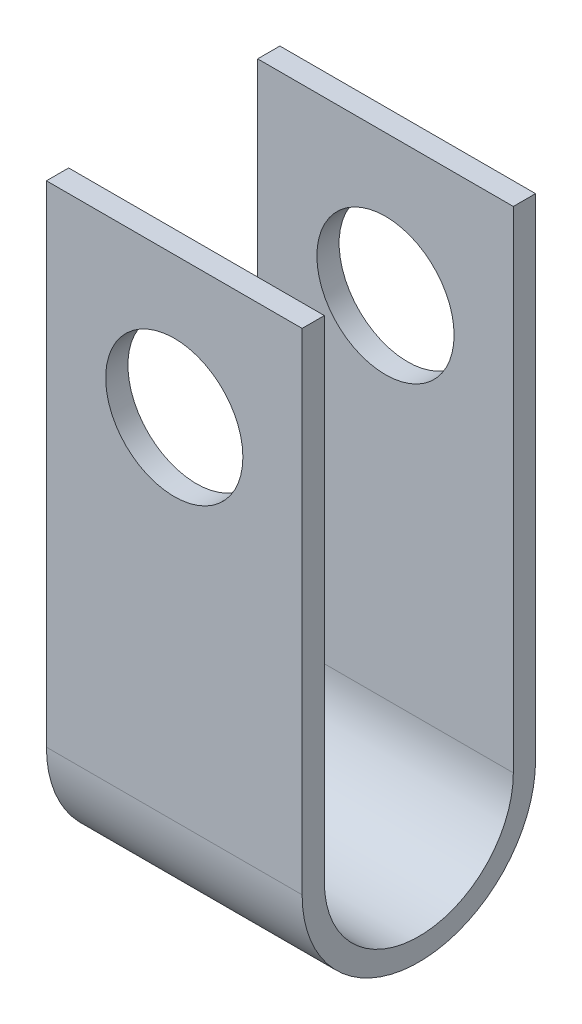
ISO-10303-21;
HEADER;
FILE_DESCRIPTION(('STEP AP214'),'2;1');
FILE_NAME('part.step','',(''),(''),'','','');
FILE_SCHEMA(('AUTOMOTIVE_DESIGN { 1 0 10303 214 1 1 1 1 }'));
ENDSEC;
DATA;
#1=APPLICATION_CONTEXT('core data for automotive mechanical design processes');
#2=APPLICATION_PROTOCOL_DEFINITION('international standard','automotive_design',2000,#1);
#3=PRODUCT_CONTEXT('',#1,'mechanical');
#4=PRODUCT('Part','Part','',(#3));
#5=PRODUCT_RELATED_PRODUCT_CATEGORY('part','',(#4));
#6=PRODUCT_DEFINITION_FORMATION('','',#4);
#7=PRODUCT_DEFINITION_CONTEXT('part definition',#1,'design');
#8=PRODUCT_DEFINITION('design','',#6,#7);
#9=PRODUCT_DEFINITION_SHAPE('','',#8);
#10=(LENGTH_UNIT() NAMED_UNIT(*) SI_UNIT(.MILLI.,.METRE.));
#11=(NAMED_UNIT(*) PLANE_ANGLE_UNIT() SI_UNIT($,.RADIAN.));
#12=(NAMED_UNIT(*) SI_UNIT($,.STERADIAN.) SOLID_ANGLE_UNIT());
#13=UNCERTAINTY_MEASURE_WITH_UNIT(LENGTH_MEASURE(1.E-05),#10,'distance_accuracy_value','');
#14=(GEOMETRIC_REPRESENTATION_CONTEXT(3) GLOBAL_UNCERTAINTY_ASSIGNED_CONTEXT((#13)) GLOBAL_UNIT_ASSIGNED_CONTEXT((#10,
#11,#12)) REPRESENTATION_CONTEXT('',''));
#15=CARTESIAN_POINT('',(0.,0.,0.));
#16=DIRECTION('',(0.,0.,1.));
#17=DIRECTION('',(1.,0.,0.));
#18=AXIS2_PLACEMENT_3D('',#15,#16,#17);
#19=CARTESIAN_POINT('',(11.5,-13.3553157194639,0.));
#20=DIRECTION('',(-1.,0.,0.));
#21=DIRECTION('',(0.,0.,1.));
#22=AXIS2_PLACEMENT_3D('',#19,#20,#21);
#23=CYLINDRICAL_SURFACE('',#22,8.50000000000006);
#24=CARTESIAN_POINT('',(-11.5,-13.3553157194639,0.));
#25=DIRECTION('',(-1.,0.,0.));
#26=DIRECTION('',(0.,0.,-1.));
#27=AXIS2_PLACEMENT_3D('',#24,#25,#26);
#28=CIRCLE('',#27,8.50000000000006);
#29=CARTESIAN_POINT('',(-11.5,-13.3553157194639,-8.50000000000006));
#30=VERTEX_POINT('',#29);
#31=CARTESIAN_POINT('',(-11.5,-13.3553157194639,8.50000000000006));
#32=VERTEX_POINT('',#31);
#33=EDGE_CURVE('E132',#30,#32,#28,.T.);
#34=ORIENTED_EDGE('',*,*,#33,.T.);
#35=DIRECTION('',(-1.,0.,0.));
#36=VECTOR('',#35,1.);
#37=CARTESIAN_POINT('',(11.5,-13.3553157194639,8.50000000000006));
#38=LINE('',#37,#36);
#39=CARTESIAN_POINT('',(11.5,-13.3553157194639,8.50000000000006));
#40=VERTEX_POINT('',#39);
#41=EDGE_CURVE('E11',#40,#32,#38,.T.);
#42=ORIENTED_EDGE('',*,*,#41,.F.);
#43=CARTESIAN_POINT('',(11.5,-13.3553157194639,0.));
#44=DIRECTION('',(-1.,0.,0.));
#45=DIRECTION('',(0.,0.,-1.));
#46=AXIS2_PLACEMENT_3D('',#43,#44,#45);
#47=CIRCLE('',#46,8.50000000000006);
#48=CARTESIAN_POINT('',(11.5,-13.3553157194639,-8.50000000000006));
#49=VERTEX_POINT('',#48);
#50=EDGE_CURVE('E147',#49,#40,#47,.T.);
#51=ORIENTED_EDGE('',*,*,#50,.F.);
#52=DIRECTION('',(-1.,0.,0.));
#53=VECTOR('',#52,1.);
#54=CARTESIAN_POINT('',(11.5,-13.3553157194639,-8.50000000000006));
#55=LINE('',#54,#53);
#56=EDGE_CURVE('E128',#49,#30,#55,.T.);
#57=ORIENTED_EDGE('',*,*,#56,.T.);
#58=EDGE_LOOP('',(#34,#42,#51,#57));
#59=FACE_BOUND('',#58,.T.);
#60=ADVANCED_FACE('F35',(#59),#23,.F.);
#61=CARTESIAN_POINT('',(11.5,-13.3553157194639,8.50000000000006));
#62=DIRECTION('',(0.,0.,1.));
#63=DIRECTION('',(1.,0.,0.));
#64=AXIS2_PLACEMENT_3D('',#61,#62,#63);
#65=PLANE('',#64);
#66=CARTESIAN_POINT('',(0.,18.0824960216368,8.50000000000006));
#67=DIRECTION('',(0.,0.,1.));
#68=DIRECTION('',(1.,0.,0.));
#69=AXIS2_PLACEMENT_3D('',#66,#67,#68);
#70=CIRCLE('',#69,6.17179632287383);
#71=CARTESIAN_POINT('',(6.17179632287383,18.0824960216368,8.50000000000006));
#72=VERTEX_POINT('',#71);
#73=EDGE_CURVE('E136',#72,#72,#70,.T.);
#74=ORIENTED_EDGE('',*,*,#73,.T.);
#75=EDGE_LOOP('',(#74));
#76=FACE_BOUND('',#75,.T.);
#77=DIRECTION('',(0.,1.,0.));
#78=VECTOR('',#77,1.);
#79=CARTESIAN_POINT('',(-11.5,-13.3553157194639,8.50000000000006));
#80=LINE('',#79,#78);
#81=CARTESIAN_POINT('',(-11.5,30.769844030865,8.50000000000006));
#82=VERTEX_POINT('',#81);
#83=EDGE_CURVE('E135',#32,#82,#80,.T.);
#84=ORIENTED_EDGE('',*,*,#83,.T.);
#85=DIRECTION('',(-1.,0.,0.));
#86=VECTOR('',#85,1.);
#87=CARTESIAN_POINT('',(11.5,30.769844030865,8.50000000000006));
#88=LINE('',#87,#86);
#89=CARTESIAN_POINT('',(11.5,30.769844030865,8.50000000000006));
#90=VERTEX_POINT('',#89);
#91=EDGE_CURVE('E44',#90,#82,#88,.T.);
#92=ORIENTED_EDGE('',*,*,#91,.F.);
#93=DIRECTION('',(0.,1.,0.));
#94=VECTOR('',#93,1.);
#95=CARTESIAN_POINT('',(11.5,-13.3553157194639,8.50000000000006));
#96=LINE('',#95,#94);
#97=EDGE_CURVE('E95',#40,#90,#96,.T.);
#98=ORIENTED_EDGE('',*,*,#97,.F.);
#99=ORIENTED_EDGE('',*,*,#41,.T.);
#100=EDGE_LOOP('',(#84,#92,#98,#99));
#101=FACE_BOUND('',#100,.T.);
#102=ADVANCED_FACE('F208',(#76,#101),#65,.F.);
#103=CARTESIAN_POINT('',(11.5,30.769844030865,10.5000000000001));
#104=DIRECTION('',(0.,-1.,0.));
#105=DIRECTION('',(0.,0.,-1.));
#106=AXIS2_PLACEMENT_3D('',#103,#104,#105);
#107=PLANE('',#106);
#108=DIRECTION('',(0.,0.,1.));
#109=VECTOR('',#108,1.);
#110=CARTESIAN_POINT('',(-11.5,30.769844030865,10.5000000000001));
#111=LINE('',#110,#109);
#112=CARTESIAN_POINT('',(-11.5,30.769844030865,10.5000000000001));
#113=VERTEX_POINT('',#112);
#114=EDGE_CURVE('E138',#82,#113,#111,.T.);
#115=ORIENTED_EDGE('',*,*,#114,.T.);
#116=DIRECTION('',(-1.,0.,0.));
#117=VECTOR('',#116,1.);
#118=CARTESIAN_POINT('',(11.5,30.769844030865,10.5000000000001));
#119=LINE('',#118,#117);
#120=CARTESIAN_POINT('',(11.5,30.769844030865,10.5000000000001));
#121=VERTEX_POINT('',#120);
#122=EDGE_CURVE('E154',#121,#113,#119,.T.);
#123=ORIENTED_EDGE('',*,*,#122,.F.);
#124=DIRECTION('',(0.,0.,1.));
#125=VECTOR('',#124,1.);
#126=CARTESIAN_POINT('',(11.5,30.769844030865,10.5000000000001));
#127=LINE('',#126,#125);
#128=EDGE_CURVE('E163',#90,#121,#127,.T.);
#129=ORIENTED_EDGE('',*,*,#128,.F.);
#130=ORIENTED_EDGE('',*,*,#91,.T.);
#131=EDGE_LOOP('',(#115,#123,#129,#130));
#132=FACE_BOUND('',#131,.T.);
#133=ADVANCED_FACE('F161',(#132),#107,.F.);
#134=CARTESIAN_POINT('',(11.5,-13.3553157194639,10.5000000000001));
#135=DIRECTION('',(0.,0.,-1.));
#136=DIRECTION('',(-1.,0.,0.));
#137=AXIS2_PLACEMENT_3D('',#134,#135,#136);
#138=PLANE('',#137);
#139=CARTESIAN_POINT('',(0.,18.0824960216368,10.5000000000001));
#140=DIRECTION('',(0.,0.,1.));
#141=DIRECTION('',(1.,0.,0.));
#142=AXIS2_PLACEMENT_3D('',#139,#140,#141);
#143=CIRCLE('',#142,6.17179632287383);
#144=CARTESIAN_POINT('',(6.17179632287383,18.0824960216368,10.5000000000001));
#145=VERTEX_POINT('',#144);
#146=EDGE_CURVE('E183',#145,#145,#143,.T.);
#147=ORIENTED_EDGE('',*,*,#146,.F.);
#148=EDGE_LOOP('',(#147));
#149=FACE_BOUND('',#148,.T.);
#150=DIRECTION('',(0.,-1.,0.));
#151=VECTOR('',#150,1.);
#152=CARTESIAN_POINT('',(-11.5,-13.3553157194639,10.5000000000001));
#153=LINE('',#152,#151);
#154=CARTESIAN_POINT('',(-11.5,-13.3553157194639,10.5000000000001));
#155=VERTEX_POINT('',#154);
#156=EDGE_CURVE('E140',#113,#155,#153,.T.);
#157=ORIENTED_EDGE('',*,*,#156,.T.);
#158=DIRECTION('',(-1.,0.,0.));
#159=VECTOR('',#158,1.);
#160=CARTESIAN_POINT('',(11.5,-13.3553157194639,10.5000000000001));
#161=LINE('',#160,#159);
#162=CARTESIAN_POINT('',(11.5,-13.3553157194639,10.5000000000001));
#163=VERTEX_POINT('',#162);
#164=EDGE_CURVE('E151',#163,#155,#161,.T.);
#165=ORIENTED_EDGE('',*,*,#164,.F.);
#166=DIRECTION('',(0.,-1.,0.));
#167=VECTOR('',#166,1.);
#168=CARTESIAN_POINT('',(11.5,-13.3553157194639,10.5000000000001));
#169=LINE('',#168,#167);
#170=EDGE_CURVE('E175',#121,#163,#169,.T.);
#171=ORIENTED_EDGE('',*,*,#170,.F.);
#172=ORIENTED_EDGE('',*,*,#122,.T.);
#173=EDGE_LOOP('',(#157,#165,#171,#172));
#174=FACE_BOUND('',#173,.T.);
#175=ADVANCED_FACE('F171',(#149,#174),#138,.F.);
#176=CARTESIAN_POINT('',(11.5,-13.3553157194639,0.));
#177=DIRECTION('',(-1.,0.,0.));
#178=DIRECTION('',(0.,0.,1.));
#179=AXIS2_PLACEMENT_3D('',#176,#177,#178);
#180=CYLINDRICAL_SURFACE('',#179,10.5000000000001);
#181=CARTESIAN_POINT('',(-11.5,-13.3553157194639,0.));
#182=DIRECTION('',(1.,0.,0.));
#183=DIRECTION('',(0.,0.,-1.));
#184=AXIS2_PLACEMENT_3D('',#181,#182,#183);
#185=CIRCLE('',#184,10.5000000000001);
#186=CARTESIAN_POINT('',(-11.5,-13.3553157194639,-10.5000000000001));
#187=VERTEX_POINT('',#186);
#188=EDGE_CURVE('E142',#155,#187,#185,.T.);
#189=ORIENTED_EDGE('',*,*,#188,.T.);
#190=DIRECTION('',(-1.,0.,0.));
#191=VECTOR('',#190,1.);
#192=CARTESIAN_POINT('',(11.5,-13.3553157194639,-10.5000000000001));
#193=LINE('',#192,#191);
#194=CARTESIAN_POINT('',(11.5,-13.3553157194639,-10.5000000000001));
#195=VERTEX_POINT('',#194);
#196=EDGE_CURVE('E123',#195,#187,#193,.T.);
#197=ORIENTED_EDGE('',*,*,#196,.F.);
#198=CARTESIAN_POINT('',(11.5,-13.3553157194639,0.));
#199=DIRECTION('',(1.,0.,0.));
#200=DIRECTION('',(0.,0.,-1.));
#201=AXIS2_PLACEMENT_3D('',#198,#199,#200);
#202=CIRCLE('',#201,10.5000000000001);
#203=EDGE_CURVE('E114',#163,#195,#202,.T.);
#204=ORIENTED_EDGE('',*,*,#203,.F.);
#205=ORIENTED_EDGE('',*,*,#164,.T.);
#206=EDGE_LOOP('',(#189,#197,#204,#205));
#207=FACE_BOUND('',#206,.T.);
#208=ADVANCED_FACE('F174',(#207),#180,.T.);
#209=CARTESIAN_POINT('',(11.5,-13.3553157194639,-10.5000000000001));
#210=DIRECTION('',(0.,0.,1.));
#211=DIRECTION('',(0.,-1.,0.));
#212=AXIS2_PLACEMENT_3D('',#209,#210,#211);
#213=PLANE('',#212);
#214=CARTESIAN_POINT('',(0.,18.0824960216368,-10.5000000000001));
#215=DIRECTION('',(0.,0.,1.));
#216=DIRECTION('',(1.,0.,0.));
#217=AXIS2_PLACEMENT_3D('',#214,#215,#216);
#218=CIRCLE('',#217,6.17179632287383);
#219=CARTESIAN_POINT('',(6.17179632287383,18.0824960216368,-10.5000000000001));
#220=VERTEX_POINT('',#219);
#221=EDGE_CURVE('E186',#220,#220,#218,.T.);
#222=ORIENTED_EDGE('',*,*,#221,.T.);
#223=EDGE_LOOP('',(#222));
#224=FACE_BOUND('',#223,.T.);
#225=DIRECTION('',(0.,1.,0.));
#226=VECTOR('',#225,1.);
#227=CARTESIAN_POINT('',(-11.5,-13.3553157194639,-10.5000000000001));
#228=LINE('',#227,#226);
#229=CARTESIAN_POINT('',(-11.5,30.769844030865,-10.5000000000001));
#230=VERTEX_POINT('',#229);
#231=EDGE_CURVE('E122',#187,#230,#228,.T.);
#232=ORIENTED_EDGE('',*,*,#231,.T.);
#233=DIRECTION('',(-1.,0.,0.));
#234=VECTOR('',#233,1.);
#235=CARTESIAN_POINT('',(11.5,30.769844030865,-10.5000000000001));
#236=LINE('',#235,#234);
#237=CARTESIAN_POINT('',(11.5,30.769844030865,-10.5000000000001));
#238=VERTEX_POINT('',#237);
#239=EDGE_CURVE('E119',#238,#230,#236,.T.);
#240=ORIENTED_EDGE('',*,*,#239,.F.);
#241=DIRECTION('',(0.,1.,0.));
#242=VECTOR('',#241,1.);
#243=CARTESIAN_POINT('',(11.5,-13.3553157194639,-10.5000000000001));
#244=LINE('',#243,#242);
#245=EDGE_CURVE('E108',#195,#238,#244,.T.);
#246=ORIENTED_EDGE('',*,*,#245,.F.);
#247=ORIENTED_EDGE('',*,*,#196,.T.);
#248=EDGE_LOOP('',(#232,#240,#246,#247));
#249=FACE_BOUND('',#248,.T.);
#250=ADVANCED_FACE('F120',(#224,#249),#213,.F.);
#251=CARTESIAN_POINT('',(11.5,30.769844030865,-8.50000000000006));
#252=DIRECTION('',(0.,-1.,0.));
#253=DIRECTION('',(0.,0.,-1.));
#254=AXIS2_PLACEMENT_3D('',#251,#252,#253);
#255=PLANE('',#254);
#256=DIRECTION('',(0.,0.,1.));
#257=VECTOR('',#256,1.);
#258=CARTESIAN_POINT('',(-11.5,30.769844030865,-8.50000000000006));
#259=LINE('',#258,#257);
#260=CARTESIAN_POINT('',(-11.5,30.769844030865,-8.50000000000006));
#261=VERTEX_POINT('',#260);
#262=EDGE_CURVE('E81',#230,#261,#259,.T.);
#263=ORIENTED_EDGE('',*,*,#262,.T.);
#264=DIRECTION('',(-1.,0.,0.));
#265=VECTOR('',#264,1.);
#266=CARTESIAN_POINT('',(11.5,30.769844030865,-8.50000000000006));
#267=LINE('',#266,#265);
#268=CARTESIAN_POINT('',(11.5,30.769844030865,-8.50000000000006));
#269=VERTEX_POINT('',#268);
#270=EDGE_CURVE('E124',#269,#261,#267,.T.);
#271=ORIENTED_EDGE('',*,*,#270,.F.);
#272=DIRECTION('',(0.,0.,1.));
#273=VECTOR('',#272,1.);
#274=CARTESIAN_POINT('',(11.5,30.769844030865,-8.50000000000006));
#275=LINE('',#274,#273);
#276=EDGE_CURVE('E112',#238,#269,#275,.T.);
#277=ORIENTED_EDGE('',*,*,#276,.F.);
#278=ORIENTED_EDGE('',*,*,#239,.T.);
#279=EDGE_LOOP('',(#263,#271,#277,#278));
#280=FACE_BOUND('',#279,.T.);
#281=ADVANCED_FACE('F126',(#280),#255,.F.);
#282=CARTESIAN_POINT('',(11.5,-13.3553157194639,-8.50000000000006));
#283=DIRECTION('',(0.,0.,-1.));
#284=DIRECTION('',(-1.,0.,0.));
#285=AXIS2_PLACEMENT_3D('',#282,#283,#284);
#286=PLANE('',#285);
#287=CARTESIAN_POINT('',(0.,18.0824960216368,-8.50000000000006));
#288=DIRECTION('',(0.,0.,-1.));
#289=DIRECTION('',(-1.,0.,0.));
#290=AXIS2_PLACEMENT_3D('',#287,#288,#289);
#291=CIRCLE('',#290,6.17179632287383);
#292=CARTESIAN_POINT('',(-6.17179632287383,18.0824960216368,-8.50000000000006));
#293=VERTEX_POINT('',#292);
#294=EDGE_CURVE('E38',#293,#293,#291,.T.);
#295=ORIENTED_EDGE('',*,*,#294,.T.);
#296=EDGE_LOOP('',(#295));
#297=FACE_BOUND('',#296,.T.);
#298=DIRECTION('',(0.,-1.,0.));
#299=VECTOR('',#298,1.);
#300=CARTESIAN_POINT('',(-11.5,-13.3553157194639,-8.50000000000006));
#301=LINE('',#300,#299);
#302=EDGE_CURVE('E87',#261,#30,#301,.T.);
#303=ORIENTED_EDGE('',*,*,#302,.T.);
#304=ORIENTED_EDGE('',*,*,#56,.F.);
#305=DIRECTION('',(0.,-1.,0.));
#306=VECTOR('',#305,1.);
#307=CARTESIAN_POINT('',(11.5,-13.3553157194639,-8.50000000000006));
#308=LINE('',#307,#306);
#309=EDGE_CURVE('E52',#269,#49,#308,.T.);
#310=ORIENTED_EDGE('',*,*,#309,.F.);
#311=ORIENTED_EDGE('',*,*,#270,.T.);
#312=EDGE_LOOP('',(#303,#304,#310,#311));
#313=FACE_BOUND('',#312,.T.);
#314=ADVANCED_FACE('F193',(#297,#313),#286,.F.);
#315=CARTESIAN_POINT('',(11.5,-13.3553157194639,0.));
#316=DIRECTION('',(1.,0.,0.));
#317=DIRECTION('',(0.,0.,-1.));
#318=AXIS2_PLACEMENT_3D('',#315,#316,#317);
#319=PLANE('',#318);
#320=ORIENTED_EDGE('',*,*,#50,.T.);
#321=ORIENTED_EDGE('',*,*,#97,.T.);
#322=ORIENTED_EDGE('',*,*,#128,.T.);
#323=ORIENTED_EDGE('',*,*,#170,.T.);
#324=ORIENTED_EDGE('',*,*,#203,.T.);
#325=ORIENTED_EDGE('',*,*,#245,.T.);
#326=ORIENTED_EDGE('',*,*,#276,.T.);
#327=ORIENTED_EDGE('',*,*,#309,.T.);
#328=EDGE_LOOP('',(#320,#321,#322,#323,#324,#325,#326,#327));
#329=FACE_BOUND('',#328,.T.);
#330=ADVANCED_FACE('F110',(#329),#319,.T.);
#331=CARTESIAN_POINT('',(-11.5,-13.3553157194639,0.));
#332=DIRECTION('',(1.,0.,0.));
#333=DIRECTION('',(0.,0.,-1.));
#334=AXIS2_PLACEMENT_3D('',#331,#332,#333);
#335=PLANE('',#334);
#336=ORIENTED_EDGE('',*,*,#33,.F.);
#337=ORIENTED_EDGE('',*,*,#302,.F.);
#338=ORIENTED_EDGE('',*,*,#262,.F.);
#339=ORIENTED_EDGE('',*,*,#231,.F.);
#340=ORIENTED_EDGE('',*,*,#188,.F.);
#341=ORIENTED_EDGE('',*,*,#156,.F.);
#342=ORIENTED_EDGE('',*,*,#114,.F.);
#343=ORIENTED_EDGE('',*,*,#83,.F.);
#344=EDGE_LOOP('',(#336,#337,#338,#339,#340,#341,#342,#343));
#345=FACE_BOUND('',#344,.T.);
#346=ADVANCED_FACE('F167',(#345),#335,.F.);
#347=CARTESIAN_POINT('',(0.,18.0824960216368,-10.5000000000001));
#348=DIRECTION('',(0.,0.,1.));
#349=DIRECTION('',(1.,0.,0.));
#350=AXIS2_PLACEMENT_3D('',#347,#348,#349);
#351=CYLINDRICAL_SURFACE('',#350,6.17179632287383);
#352=ORIENTED_EDGE('',*,*,#221,.F.);
#353=EDGE_LOOP('',(#352));
#354=FACE_BOUND('',#353,.T.);
#355=ORIENTED_EDGE('',*,*,#294,.F.);
#356=EDGE_LOOP('',(#355));
#357=FACE_BOUND('',#356,.T.);
#358=ADVANCED_FACE('F195',(#354,#357),#351,.F.);
#359=ORIENTED_EDGE('',*,*,#146,.T.);
#360=EDGE_LOOP('',(#359));
#361=FACE_BOUND('',#360,.T.);
#362=ORIENTED_EDGE('',*,*,#73,.F.);
#363=EDGE_LOOP('',(#362));
#364=FACE_BOUND('',#363,.T.);
#365=ADVANCED_FACE('F197',(#361,#364),#351,.F.);
#366=CLOSED_SHELL('',(#60,#102,#133,#175,#208,#250,#281,#314,#330,#346,#358,#365));
#367=MANIFOLD_SOLID_BREP('B2',#366);
#368=ADVANCED_BREP_SHAPE_REPRESENTATION('',(#18,#367),#14);
#369=SHAPE_DEFINITION_REPRESENTATION(#9,#368);
ENDSEC;
END-ISO-10303-21;
